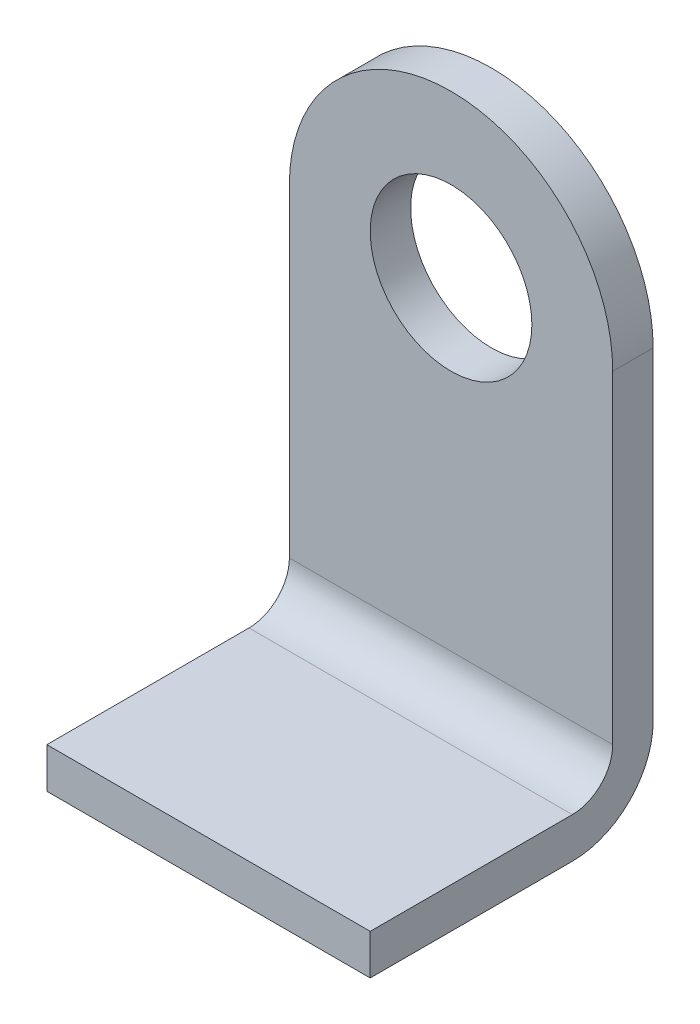
ISO-10303-21;
HEADER;
FILE_DESCRIPTION(('STEP AP214'),'2;1');
FILE_NAME('part.step','',(''),(''),'','','');
FILE_SCHEMA(('AUTOMOTIVE_DESIGN { 1 0 10303 214 1 1 1 1 }'));
ENDSEC;
DATA;
#1=APPLICATION_CONTEXT('core data for automotive mechanical design processes');
#2=APPLICATION_PROTOCOL_DEFINITION('international standard','automotive_design',2000,#1);
#3=PRODUCT_CONTEXT('',#1,'mechanical');
#4=PRODUCT('Part','Part','',(#3));
#5=PRODUCT_RELATED_PRODUCT_CATEGORY('part','',(#4));
#6=PRODUCT_DEFINITION_FORMATION('','',#4);
#7=PRODUCT_DEFINITION_CONTEXT('part definition',#1,'design');
#8=PRODUCT_DEFINITION('design','',#6,#7);
#9=PRODUCT_DEFINITION_SHAPE('','',#8);
#10=(LENGTH_UNIT() NAMED_UNIT(*) SI_UNIT(.MILLI.,.METRE.));
#11=(NAMED_UNIT(*) PLANE_ANGLE_UNIT() SI_UNIT($,.RADIAN.));
#12=(NAMED_UNIT(*) SI_UNIT($,.STERADIAN.) SOLID_ANGLE_UNIT());
#13=UNCERTAINTY_MEASURE_WITH_UNIT(LENGTH_MEASURE(1.E-05),#10,'distance_accuracy_value','');
#14=(GEOMETRIC_REPRESENTATION_CONTEXT(3) GLOBAL_UNCERTAINTY_ASSIGNED_CONTEXT((#13)) GLOBAL_UNIT_ASSIGNED_CONTEXT((#10,
#11,#12)) REPRESENTATION_CONTEXT('',''));
#15=CARTESIAN_POINT('',(0.,0.,0.));
#16=DIRECTION('',(0.,0.,1.));
#17=DIRECTION('',(1.,0.,0.));
#18=AXIS2_PLACEMENT_3D('',#15,#16,#17);
#19=CARTESIAN_POINT('',(-20.,40.,5.));
#20=DIRECTION('',(0.,0.,-1.));
#21=DIRECTION('',(-1.,0.,0.));
#22=AXIS2_PLACEMENT_3D('',#19,#20,#21);
#23=CYLINDRICAL_SURFACE('',#22,20.);
#24=CARTESIAN_POINT('',(-20.,40.,0.));
#25=DIRECTION('',(0.,0.,1.));
#26=DIRECTION('',(-1.,0.,0.));
#27=AXIS2_PLACEMENT_3D('',#24,#25,#26);
#28=CIRCLE('',#27,20.);
#29=CARTESIAN_POINT('',(0.,40.,0.));
#30=VERTEX_POINT('',#29);
#31=CARTESIAN_POINT('',(-40.,40.,0.));
#32=VERTEX_POINT('',#31);
#33=EDGE_CURVE('E141',#30,#32,#28,.T.);
#34=ORIENTED_EDGE('',*,*,#33,.T.);
#35=DIRECTION('',(0.,0.,-1.));
#36=VECTOR('',#35,1.);
#37=CARTESIAN_POINT('',(-40.,40.,5.));
#38=LINE('',#37,#36);
#39=CARTESIAN_POINT('',(-40.,40.,5.));
#40=VERTEX_POINT('',#39);
#41=EDGE_CURVE('E11',#40,#32,#38,.T.);
#42=ORIENTED_EDGE('',*,*,#41,.F.);
#43=CARTESIAN_POINT('',(-20.,40.,5.));
#44=DIRECTION('',(0.,0.,1.));
#45=DIRECTION('',(-1.,0.,0.));
#46=AXIS2_PLACEMENT_3D('',#43,#44,#45);
#47=CIRCLE('',#46,20.);
#48=CARTESIAN_POINT('',(0.,40.,5.));
#49=VERTEX_POINT('',#48);
#50=EDGE_CURVE('E146',#49,#40,#47,.T.);
#51=ORIENTED_EDGE('',*,*,#50,.F.);
#52=DIRECTION('',(0.,0.,-1.));
#53=VECTOR('',#52,1.);
#54=CARTESIAN_POINT('',(0.,40.,5.));
#55=LINE('',#54,#53);
#56=EDGE_CURVE('E40',#49,#30,#55,.T.);
#57=ORIENTED_EDGE('',*,*,#56,.T.);
#58=EDGE_LOOP('',(#34,#42,#51,#57));
#59=FACE_BOUND('',#58,.T.);
#60=ADVANCED_FACE('F32',(#59),#23,.T.);
#61=CARTESIAN_POINT('',(-40.,0.,5.));
#62=DIRECTION('',(1.,0.,0.));
#63=DIRECTION('',(0.,1.,0.));
#64=AXIS2_PLACEMENT_3D('',#61,#62,#63);
#65=PLANE('',#64);
#66=DIRECTION('',(0.,-1.,0.));
#67=VECTOR('',#66,1.);
#68=CARTESIAN_POINT('',(-40.,0.,0.));
#69=LINE('',#68,#67);
#70=CARTESIAN_POINT('',(-40.,0.,0.));
#71=VERTEX_POINT('',#70);
#72=EDGE_CURVE('E154',#32,#71,#69,.T.);
#73=ORIENTED_EDGE('',*,*,#72,.T.);
#74=CARTESIAN_POINT('',(-40.,0.,10.));
#75=DIRECTION('',(1.,0.,0.));
#76=DIRECTION('',(0.,1.,0.));
#77=AXIS2_PLACEMENT_3D('',#74,#75,#76);
#78=CIRCLE('',#77,10.);
#79=CARTESIAN_POINT('',(-40.,-10.,10.));
#80=VERTEX_POINT('',#79);
#81=EDGE_CURVE('E145',#71,#80,#78,.F.);
#82=ORIENTED_EDGE('',*,*,#81,.T.);
#83=DIRECTION('',(0.,0.,1.));
#84=VECTOR('',#83,1.);
#85=CARTESIAN_POINT('',(-40.,-10.,35.));
#86=LINE('',#85,#84);
#87=CARTESIAN_POINT('',(-40.,-10.,35.));
#88=VERTEX_POINT('',#87);
#89=EDGE_CURVE('E202',#80,#88,#86,.T.);
#90=ORIENTED_EDGE('',*,*,#89,.T.);
#91=DIRECTION('',(0.,1.,0.));
#92=VECTOR('',#91,1.);
#93=CARTESIAN_POINT('',(-40.,-5.,35.));
#94=LINE('',#93,#92);
#95=CARTESIAN_POINT('',(-40.,-5.00000000000001,35.));
#96=VERTEX_POINT('',#95);
#97=EDGE_CURVE('E207',#88,#96,#94,.T.);
#98=ORIENTED_EDGE('',*,*,#97,.T.);
#99=DIRECTION('',(0.,0.,-1.));
#100=VECTOR('',#99,1.);
#101=CARTESIAN_POINT('',(-40.,-5.,10.));
#102=LINE('',#101,#100);
#103=CARTESIAN_POINT('',(-40.,-5.,10.));
#104=VERTEX_POINT('',#103);
#105=EDGE_CURVE('E209',#96,#104,#102,.T.);
#106=ORIENTED_EDGE('',*,*,#105,.T.);
#107=CARTESIAN_POINT('',(-40.,0.,10.));
#108=DIRECTION('',(1.,0.,0.));
#109=DIRECTION('',(0.,1.,0.));
#110=AXIS2_PLACEMENT_3D('',#107,#108,#109);
#111=CIRCLE('',#110,5.);
#112=CARTESIAN_POINT('',(-40.,0.,5.));
#113=VERTEX_POINT('',#112);
#114=EDGE_CURVE('E110',#104,#113,#111,.T.);
#115=ORIENTED_EDGE('',*,*,#114,.T.);
#116=DIRECTION('',(0.,-1.,0.));
#117=VECTOR('',#116,1.);
#118=CARTESIAN_POINT('',(-40.,0.,5.));
#119=LINE('',#118,#117);
#120=EDGE_CURVE('E74',#40,#113,#119,.T.);
#121=ORIENTED_EDGE('',*,*,#120,.F.);
#122=ORIENTED_EDGE('',*,*,#41,.T.);
#123=EDGE_LOOP('',(#73,#82,#90,#98,#106,#115,#121,#122));
#124=FACE_BOUND('',#123,.T.);
#125=ADVANCED_FACE('F164',(#124),#65,.F.);
#126=CARTESIAN_POINT('',(0.,40.,5.));
#127=DIRECTION('',(-1.,0.,0.));
#128=DIRECTION('',(0.,-1.,0.));
#129=AXIS2_PLACEMENT_3D('',#126,#127,#128);
#130=PLANE('',#129);
#131=DIRECTION('',(0.,1.,0.));
#132=VECTOR('',#131,1.);
#133=CARTESIAN_POINT('',(0.,40.,0.));
#134=LINE('',#133,#132);
#135=CARTESIAN_POINT('',(0.,0.,0.));
#136=VERTEX_POINT('',#135);
#137=EDGE_CURVE('E63',#136,#30,#134,.T.);
#138=ORIENTED_EDGE('',*,*,#137,.T.);
#139=ORIENTED_EDGE('',*,*,#56,.F.);
#140=DIRECTION('',(0.,1.,0.));
#141=VECTOR('',#140,1.);
#142=CARTESIAN_POINT('',(0.,40.,5.));
#143=LINE('',#142,#141);
#144=CARTESIAN_POINT('',(0.,0.,5.));
#145=VERTEX_POINT('',#144);
#146=EDGE_CURVE('E48',#145,#49,#143,.T.);
#147=ORIENTED_EDGE('',*,*,#146,.F.);
#148=CARTESIAN_POINT('',(0.,0.,10.));
#149=DIRECTION('',(-1.,0.,0.));
#150=DIRECTION('',(0.,-1.,0.));
#151=AXIS2_PLACEMENT_3D('',#148,#149,#150);
#152=CIRCLE('',#151,5.);
#153=CARTESIAN_POINT('',(0.,-5.,10.));
#154=VERTEX_POINT('',#153);
#155=EDGE_CURVE('E109',#145,#154,#152,.T.);
#156=ORIENTED_EDGE('',*,*,#155,.T.);
#157=DIRECTION('',(0.,0.,1.));
#158=VECTOR('',#157,1.);
#159=CARTESIAN_POINT('',(0.,-5.,10.));
#160=LINE('',#159,#158);
#161=CARTESIAN_POINT('',(0.,-5.,35.));
#162=VERTEX_POINT('',#161);
#163=EDGE_CURVE('E117',#154,#162,#160,.T.);
#164=ORIENTED_EDGE('',*,*,#163,.T.);
#165=DIRECTION('',(0.,-1.,0.));
#166=VECTOR('',#165,1.);
#167=CARTESIAN_POINT('',(0.,-5.,35.));
#168=LINE('',#167,#166);
#169=CARTESIAN_POINT('',(0.,-10.,35.));
#170=VERTEX_POINT('',#169);
#171=EDGE_CURVE('E122',#162,#170,#168,.T.);
#172=ORIENTED_EDGE('',*,*,#171,.T.);
#173=DIRECTION('',(0.,0.,-1.));
#174=VECTOR('',#173,1.);
#175=CARTESIAN_POINT('',(0.,-10.,35.));
#176=LINE('',#175,#174);
#177=CARTESIAN_POINT('',(0.,-10.,10.));
#178=VERTEX_POINT('',#177);
#179=EDGE_CURVE('E114',#170,#178,#176,.T.);
#180=ORIENTED_EDGE('',*,*,#179,.T.);
#181=CARTESIAN_POINT('',(0.,0.,10.));
#182=DIRECTION('',(1.,0.,0.));
#183=DIRECTION('',(0.,-1.,0.));
#184=AXIS2_PLACEMENT_3D('',#181,#182,#183);
#185=CIRCLE('',#184,10.);
#186=EDGE_CURVE('E125',#178,#136,#185,.T.);
#187=ORIENTED_EDGE('',*,*,#186,.T.);
#188=EDGE_LOOP('',(#138,#139,#147,#156,#164,#172,#180,#187));
#189=FACE_BOUND('',#188,.T.);
#190=ADVANCED_FACE('F124',(#189),#130,.F.);
#191=CARTESIAN_POINT('',(-20.,40.,5.));
#192=DIRECTION('',(0.,0.,-1.));
#193=DIRECTION('',(-1.,0.,0.));
#194=AXIS2_PLACEMENT_3D('',#191,#192,#193);
#195=PLANE('',#194);
#196=CARTESIAN_POINT('',(-20.,40.,5.));
#197=DIRECTION('',(0.,0.,1.));
#198=DIRECTION('',(1.,0.,0.));
#199=AXIS2_PLACEMENT_3D('',#196,#197,#198);
#200=CIRCLE('',#199,10.);
#201=CARTESIAN_POINT('',(-10.,40.,5.));
#202=VERTEX_POINT('',#201);
#203=EDGE_CURVE('E142',#202,#202,#200,.T.);
#204=ORIENTED_EDGE('',*,*,#203,.F.);
#205=EDGE_LOOP('',(#204));
#206=FACE_BOUND('',#205,.T.);
#207=ORIENTED_EDGE('',*,*,#50,.T.);
#208=ORIENTED_EDGE('',*,*,#120,.T.);
#209=DIRECTION('',(1.,0.,0.));
#210=VECTOR('',#209,1.);
#211=CARTESIAN_POINT('',(0.,0.,5.));
#212=LINE('',#211,#210);
#213=EDGE_CURVE('E149',#113,#145,#212,.T.);
#214=ORIENTED_EDGE('',*,*,#213,.T.);
#215=ORIENTED_EDGE('',*,*,#146,.T.);
#216=EDGE_LOOP('',(#207,#208,#214,#215));
#217=FACE_BOUND('',#216,.T.);
#218=ADVANCED_FACE('F170',(#206,#217),#195,.F.);
#219=CARTESIAN_POINT('',(-20.,40.,0.));
#220=DIRECTION('',(0.,0.,-1.));
#221=DIRECTION('',(-1.,0.,0.));
#222=AXIS2_PLACEMENT_3D('',#219,#220,#221);
#223=PLANE('',#222);
#224=CARTESIAN_POINT('',(-20.,40.,0.));
#225=DIRECTION('',(0.,0.,1.));
#226=DIRECTION('',(1.,0.,0.));
#227=AXIS2_PLACEMENT_3D('',#224,#225,#226);
#228=CIRCLE('',#227,10.);
#229=CARTESIAN_POINT('',(-10.,40.,0.));
#230=VERTEX_POINT('',#229);
#231=EDGE_CURVE('E138',#230,#230,#228,.T.);
#232=ORIENTED_EDGE('',*,*,#231,.T.);
#233=EDGE_LOOP('',(#232));
#234=FACE_BOUND('',#233,.T.);
#235=ORIENTED_EDGE('',*,*,#33,.F.);
#236=ORIENTED_EDGE('',*,*,#137,.F.);
#237=DIRECTION('',(1.,0.,0.));
#238=VECTOR('',#237,1.);
#239=CARTESIAN_POINT('',(0.,0.,0.));
#240=LINE('',#239,#238);
#241=EDGE_CURVE('E157',#71,#136,#240,.T.);
#242=ORIENTED_EDGE('',*,*,#241,.F.);
#243=ORIENTED_EDGE('',*,*,#72,.F.);
#244=EDGE_LOOP('',(#235,#236,#242,#243));
#245=FACE_BOUND('',#244,.T.);
#246=ADVANCED_FACE('F162',(#234,#245),#223,.T.);
#247=CARTESIAN_POINT('',(-20.,40.,0.));
#248=DIRECTION('',(0.,0.,1.));
#249=DIRECTION('',(1.,0.,0.));
#250=AXIS2_PLACEMENT_3D('',#247,#248,#249);
#251=CYLINDRICAL_SURFACE('',#250,10.);
#252=ORIENTED_EDGE('',*,*,#231,.F.);
#253=EDGE_LOOP('',(#252));
#254=FACE_BOUND('',#253,.T.);
#255=ORIENTED_EDGE('',*,*,#203,.T.);
#256=EDGE_LOOP('',(#255));
#257=FACE_BOUND('',#256,.T.);
#258=ADVANCED_FACE('F175',(#254,#257),#251,.F.);
#259=CARTESIAN_POINT('',(-76.4005494464026,0.,10.));
#260=DIRECTION('',(1.,0.,0.));
#261=DIRECTION('',(0.,1.,0.));
#262=AXIS2_PLACEMENT_3D('',#259,#260,#261);
#263=CYLINDRICAL_SURFACE('',#262,10.);
#264=ORIENTED_EDGE('',*,*,#81,.F.);
#265=ORIENTED_EDGE('',*,*,#241,.T.);
#266=ORIENTED_EDGE('',*,*,#186,.F.);
#267=DIRECTION('',(1.,0.,0.));
#268=VECTOR('',#267,1.);
#269=CARTESIAN_POINT('',(-76.4005494464026,-10.,10.));
#270=LINE('',#269,#268);
#271=EDGE_CURVE('E133',#80,#178,#270,.T.);
#272=ORIENTED_EDGE('',*,*,#271,.F.);
#273=EDGE_LOOP('',(#264,#265,#266,#272));
#274=FACE_BOUND('',#273,.T.);
#275=ADVANCED_FACE('F182',(#274),#263,.T.);
#276=CARTESIAN_POINT('',(-76.4005494464026,-10.,35.));
#277=DIRECTION('',(0.,-1.,0.));
#278=DIRECTION('',(0.,0.,-1.));
#279=AXIS2_PLACEMENT_3D('',#276,#277,#278);
#280=PLANE('',#279);
#281=ORIENTED_EDGE('',*,*,#89,.F.);
#282=ORIENTED_EDGE('',*,*,#271,.T.);
#283=ORIENTED_EDGE('',*,*,#179,.F.);
#284=DIRECTION('',(1.,0.,0.));
#285=VECTOR('',#284,1.);
#286=CARTESIAN_POINT('',(-76.4005494464026,-10.,35.));
#287=LINE('',#286,#285);
#288=EDGE_CURVE('E135',#88,#170,#287,.T.);
#289=ORIENTED_EDGE('',*,*,#288,.F.);
#290=EDGE_LOOP('',(#281,#282,#283,#289));
#291=FACE_BOUND('',#290,.T.);
#292=ADVANCED_FACE('F186',(#291),#280,.T.);
#293=CARTESIAN_POINT('',(-76.4005494464026,-5.00000000000001,35.));
#294=DIRECTION('',(0.,0.,1.));
#295=DIRECTION('',(1.,0.,0.));
#296=AXIS2_PLACEMENT_3D('',#293,#294,#295);
#297=PLANE('',#296);
#298=ORIENTED_EDGE('',*,*,#97,.F.);
#299=ORIENTED_EDGE('',*,*,#288,.T.);
#300=ORIENTED_EDGE('',*,*,#171,.F.);
#301=DIRECTION('',(1.,0.,0.));
#302=VECTOR('',#301,1.);
#303=CARTESIAN_POINT('',(-76.4005494464026,-5.00000000000001,35.));
#304=LINE('',#303,#302);
#305=EDGE_CURVE('E113',#96,#162,#304,.T.);
#306=ORIENTED_EDGE('',*,*,#305,.F.);
#307=EDGE_LOOP('',(#298,#299,#300,#306));
#308=FACE_BOUND('',#307,.T.);
#309=ADVANCED_FACE('F192',(#308),#297,.T.);
#310=CARTESIAN_POINT('',(-76.4005494464026,-5.,10.));
#311=DIRECTION('',(0.,1.,0.));
#312=DIRECTION('',(0.,0.,1.));
#313=AXIS2_PLACEMENT_3D('',#310,#311,#312);
#314=PLANE('',#313);
#315=ORIENTED_EDGE('',*,*,#105,.F.);
#316=ORIENTED_EDGE('',*,*,#305,.T.);
#317=ORIENTED_EDGE('',*,*,#163,.F.);
#318=DIRECTION('',(1.,0.,0.));
#319=VECTOR('',#318,1.);
#320=CARTESIAN_POINT('',(-76.4005494464026,-5.,10.));
#321=LINE('',#320,#319);
#322=EDGE_CURVE('E104',#104,#154,#321,.T.);
#323=ORIENTED_EDGE('',*,*,#322,.F.);
#324=EDGE_LOOP('',(#315,#316,#317,#323));
#325=FACE_BOUND('',#324,.T.);
#326=ADVANCED_FACE('F118',(#325),#314,.T.);
#327=CARTESIAN_POINT('',(-76.4005494464026,0.,10.));
#328=DIRECTION('',(1.,0.,0.));
#329=DIRECTION('',(0.,1.,0.));
#330=AXIS2_PLACEMENT_3D('',#327,#328,#329);
#331=CYLINDRICAL_SURFACE('',#330,5.);
#332=ORIENTED_EDGE('',*,*,#114,.F.);
#333=ORIENTED_EDGE('',*,*,#322,.T.);
#334=ORIENTED_EDGE('',*,*,#155,.F.);
#335=ORIENTED_EDGE('',*,*,#213,.F.);
#336=EDGE_LOOP('',(#332,#333,#334,#335));
#337=FACE_BOUND('',#336,.T.);
#338=ADVANCED_FACE('F106',(#337),#331,.F.);
#339=CLOSED_SHELL('',(#60,#125,#190,#218,#246,#258,#275,#292,#309,#326,#338));
#340=MANIFOLD_SOLID_BREP('B2',#339);
#341=ADVANCED_BREP_SHAPE_REPRESENTATION('',(#18,#340),#14);
#342=SHAPE_DEFINITION_REPRESENTATION(#9,#341);
ENDSEC;
END-ISO-10303-21;
